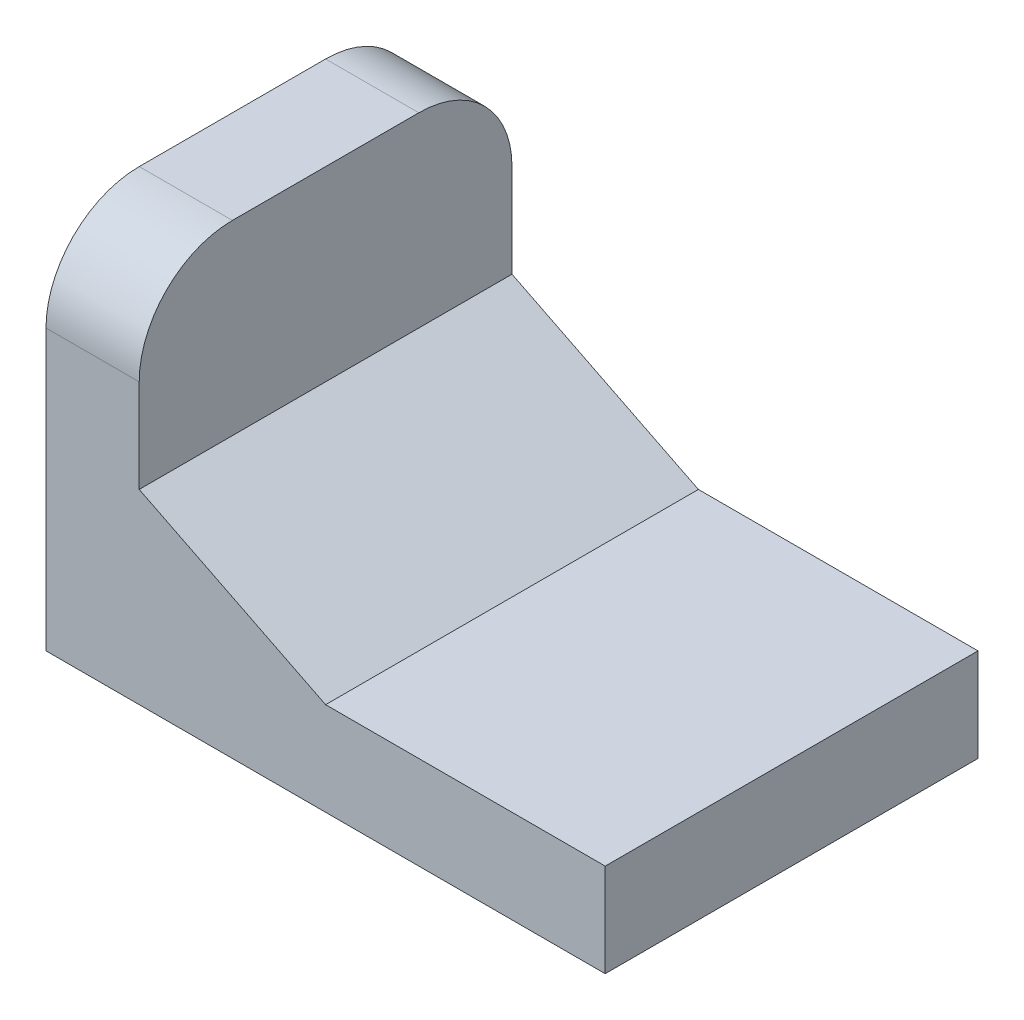
ISO-10303-21;
HEADER;
FILE_DESCRIPTION(('STEP AP214'),'2;1');
FILE_NAME('part.step','',(''),(''),'','','');
FILE_SCHEMA(('AUTOMOTIVE_DESIGN { 1 0 10303 214 1 1 1 1 }'));
ENDSEC;
DATA;
#1=APPLICATION_CONTEXT('core data for automotive mechanical design processes');
#2=APPLICATION_PROTOCOL_DEFINITION('international standard','automotive_design',2000,#1);
#3=PRODUCT_CONTEXT('',#1,'mechanical');
#4=PRODUCT('Part','Part','',(#3));
#5=PRODUCT_RELATED_PRODUCT_CATEGORY('part','',(#4));
#6=PRODUCT_DEFINITION_FORMATION('','',#4);
#7=PRODUCT_DEFINITION_CONTEXT('part definition',#1,'design');
#8=PRODUCT_DEFINITION('design','',#6,#7);
#9=PRODUCT_DEFINITION_SHAPE('','',#8);
#10=(LENGTH_UNIT() NAMED_UNIT(*) SI_UNIT(.MILLI.,.METRE.));
#11=(NAMED_UNIT(*) PLANE_ANGLE_UNIT() SI_UNIT($,.RADIAN.));
#12=(NAMED_UNIT(*) SI_UNIT($,.STERADIAN.) SOLID_ANGLE_UNIT());
#13=UNCERTAINTY_MEASURE_WITH_UNIT(LENGTH_MEASURE(1.E-05),#10,'distance_accuracy_value','');
#14=(GEOMETRIC_REPRESENTATION_CONTEXT(3) GLOBAL_UNCERTAINTY_ASSIGNED_CONTEXT((#13)) GLOBAL_UNIT_ASSIGNED_CONTEXT((#10,
#11,#12)) REPRESENTATION_CONTEXT('',''));
#15=CARTESIAN_POINT('',(0.,0.,0.));
#16=DIRECTION('',(0.,0.,1.));
#17=DIRECTION('',(1.,0.,0.));
#18=AXIS2_PLACEMENT_3D('',#15,#16,#17);
#19=CARTESIAN_POINT('',(8.53680720828743,4.62082072878893,12.));
#20=DIRECTION('',(0.,1.,0.));
#21=DIRECTION('',(0.,0.,1.));
#22=AXIS2_PLACEMENT_3D('',#19,#20,#21);
#23=PLANE('',#22);
#24=DIRECTION('',(1.,0.,0.));
#25=VECTOR('',#24,1.);
#26=CARTESIAN_POINT('',(8.53680720828743,4.62082072878893,8.));
#27=LINE('',#26,#25);
#28=CARTESIAN_POINT('',(8.53680720828743,4.62082072878893,8.));
#29=VERTEX_POINT('',#28);
#30=CARTESIAN_POINT('',(14.5368072082874,4.62082072878893,8.));
#31=VERTEX_POINT('',#30);
#32=EDGE_CURVE('E131',#29,#31,#27,.T.);
#33=ORIENTED_EDGE('',*,*,#32,.T.);
#34=DIRECTION('',(0.,0.,-1.));
#35=VECTOR('',#34,1.);
#36=CARTESIAN_POINT('',(14.5368072082874,4.62082072878893,12.));
#37=LINE('',#36,#35);
#38=CARTESIAN_POINT('',(14.5368072082874,4.62082072878893,12.));
#39=VERTEX_POINT('',#38);
#40=EDGE_CURVE('E116',#39,#31,#37,.T.);
#41=ORIENTED_EDGE('',*,*,#40,.F.);
#42=DIRECTION('',(1.,0.,0.));
#43=VECTOR('',#42,1.);
#44=CARTESIAN_POINT('',(8.53680720828743,4.62082072878893,12.));
#45=LINE('',#44,#43);
#46=CARTESIAN_POINT('',(8.53680720828743,4.62082072878893,12.));
#47=VERTEX_POINT('',#46);
#48=EDGE_CURVE('E122',#47,#39,#45,.T.);
#49=ORIENTED_EDGE('',*,*,#48,.F.);
#50=DIRECTION('',(0.,0.,-1.));
#51=VECTOR('',#50,1.);
#52=CARTESIAN_POINT('',(8.53680720828743,4.62082072878893,12.));
#53=LINE('',#52,#51);
#54=EDGE_CURVE('E174',#47,#29,#53,.T.);
#55=ORIENTED_EDGE('',*,*,#54,.T.);
#56=EDGE_LOOP('',(#33,#41,#49,#55));
#57=FACE_BOUND('',#56,.T.);
#58=ADVANCED_FACE('F38',(#57),#23,.F.);
#59=CARTESIAN_POINT('',(14.5368072082874,4.62082072878893,12.));
#60=DIRECTION('',(-1.,0.,0.));
#61=DIRECTION('',(0.,0.,1.));
#62=AXIS2_PLACEMENT_3D('',#59,#60,#61);
#63=PLANE('',#62);
#64=DIRECTION('',(0.,1.,0.));
#65=VECTOR('',#64,1.);
#66=CARTESIAN_POINT('',(14.5368072082874,4.62082072878893,8.));
#67=LINE('',#66,#65);
#68=CARTESIAN_POINT('',(14.5368072082874,5.62082072878893,8.));
#69=VERTEX_POINT('',#68);
#70=EDGE_CURVE('E190',#31,#69,#67,.T.);
#71=ORIENTED_EDGE('',*,*,#70,.T.);
#72=DIRECTION('',(0.,0.,-1.));
#73=VECTOR('',#72,1.);
#74=CARTESIAN_POINT('',(14.5368072082874,5.62082072878893,12.));
#75=LINE('',#74,#73);
#76=CARTESIAN_POINT('',(14.5368072082874,5.62082072878893,12.));
#77=VERTEX_POINT('',#76);
#78=EDGE_CURVE('E118',#77,#69,#75,.T.);
#79=ORIENTED_EDGE('',*,*,#78,.F.);
#80=DIRECTION('',(0.,1.,0.));
#81=VECTOR('',#80,1.);
#82=CARTESIAN_POINT('',(14.5368072082874,4.62082072878893,12.));
#83=LINE('',#82,#81);
#84=EDGE_CURVE('E111',#39,#77,#83,.T.);
#85=ORIENTED_EDGE('',*,*,#84,.F.);
#86=ORIENTED_EDGE('',*,*,#40,.T.);
#87=EDGE_LOOP('',(#71,#79,#85,#86));
#88=FACE_BOUND('',#87,.T.);
#89=ADVANCED_FACE('F114',(#88),#63,.F.);
#90=CARTESIAN_POINT('',(8.53680720828743,5.62082072878893,12.));
#91=DIRECTION('',(0.,1.,0.));
#92=DIRECTION('',(0.,0.,1.));
#93=AXIS2_PLACEMENT_3D('',#90,#91,#92);
#94=PLANE('',#93);
#95=DIRECTION('',(1.,0.,0.));
#96=VECTOR('',#95,1.);
#97=CARTESIAN_POINT('',(8.53680720828743,5.62082072878893,8.));
#98=LINE('',#97,#96);
#99=CARTESIAN_POINT('',(11.5368072082874,5.62082072878893,8.));
#100=VERTEX_POINT('',#99);
#101=EDGE_CURVE('E187',#100,#69,#98,.T.);
#102=ORIENTED_EDGE('',*,*,#101,.F.);
#103=DIRECTION('',(0.,0.,-1.));
#104=VECTOR('',#103,1.);
#105=CARTESIAN_POINT('',(11.5368072082874,5.62082072878893,12.));
#106=LINE('',#105,#104);
#107=CARTESIAN_POINT('',(11.5368072082874,5.62082072878893,12.));
#108=VERTEX_POINT('',#107);
#109=EDGE_CURVE('E137',#108,#100,#106,.T.);
#110=ORIENTED_EDGE('',*,*,#109,.F.);
#111=DIRECTION('',(1.,0.,0.));
#112=VECTOR('',#111,1.);
#113=CARTESIAN_POINT('',(8.53680720828743,5.62082072878893,12.));
#114=LINE('',#113,#112);
#115=EDGE_CURVE('E121',#108,#77,#114,.T.);
#116=ORIENTED_EDGE('',*,*,#115,.T.);
#117=ORIENTED_EDGE('',*,*,#78,.T.);
#118=EDGE_LOOP('',(#102,#110,#116,#117));
#119=FACE_BOUND('',#118,.T.);
#120=ADVANCED_FACE('F189',(#119),#94,.T.);
#121=CARTESIAN_POINT('',(9.53680720828743,6.62082072878893,12.));
#122=DIRECTION('',(-0.447213595499958,-0.894427190999916,0.));
#123=DIRECTION('',(0.894427190999916,-0.447213595499958,0.));
#124=AXIS2_PLACEMENT_3D('',#121,#122,#123);
#125=PLANE('',#124);
#126=DIRECTION('',(-0.894427190999916,0.447213595499958,0.));
#127=VECTOR('',#126,1.);
#128=CARTESIAN_POINT('',(9.53680720828743,6.62082072878893,8.));
#129=LINE('',#128,#127);
#130=CARTESIAN_POINT('',(9.53680720828743,6.62082072878893,8.));
#131=VERTEX_POINT('',#130);
#132=EDGE_CURVE('E182',#100,#131,#129,.T.);
#133=ORIENTED_EDGE('',*,*,#132,.T.);
#134=DIRECTION('',(0.,0.,-1.));
#135=VECTOR('',#134,1.);
#136=CARTESIAN_POINT('',(9.53680720828743,6.62082072878893,12.));
#137=LINE('',#136,#135);
#138=CARTESIAN_POINT('',(9.53680720828743,6.62082072878893,12.));
#139=VERTEX_POINT('',#138);
#140=EDGE_CURVE('E171',#139,#131,#137,.T.);
#141=ORIENTED_EDGE('',*,*,#140,.F.);
#142=DIRECTION('',(-0.894427190999916,0.447213595499958,0.));
#143=VECTOR('',#142,1.);
#144=CARTESIAN_POINT('',(9.53680720828743,6.62082072878893,12.));
#145=LINE('',#144,#143);
#146=EDGE_CURVE('E183',#108,#139,#145,.T.);
#147=ORIENTED_EDGE('',*,*,#146,.F.);
#148=ORIENTED_EDGE('',*,*,#109,.T.);
#149=EDGE_LOOP('',(#133,#141,#147,#148));
#150=FACE_BOUND('',#149,.T.);
#151=ADVANCED_FACE('F180',(#150),#125,.F.);
#152=CARTESIAN_POINT('',(9.53680720828743,4.62082072878893,12.));
#153=DIRECTION('',(-1.,0.,0.));
#154=DIRECTION('',(0.,-1.,0.));
#155=AXIS2_PLACEMENT_3D('',#152,#153,#154);
#156=PLANE('',#155);
#157=DIRECTION('',(0.,1.,0.));
#158=VECTOR('',#157,1.);
#159=CARTESIAN_POINT('',(9.53680720828743,4.62082072878893,8.));
#160=LINE('',#159,#158);
#161=CARTESIAN_POINT('',(9.53680720828743,7.62082072878893,8.));
#162=VERTEX_POINT('',#161);
#163=EDGE_CURVE('E161',#131,#162,#160,.T.);
#164=ORIENTED_EDGE('',*,*,#163,.T.);
#165=CARTESIAN_POINT('',(9.53680720828743,7.62082072878893,9.));
#166=DIRECTION('',(-1.,0.,0.));
#167=DIRECTION('',(0.,-1.,0.));
#168=AXIS2_PLACEMENT_3D('',#165,#166,#167);
#169=CIRCLE('',#168,1.);
#170=CARTESIAN_POINT('',(9.53680720828743,8.62082072878893,9.));
#171=VERTEX_POINT('',#170);
#172=EDGE_CURVE('E142',#162,#171,#169,.F.);
#173=ORIENTED_EDGE('',*,*,#172,.T.);
#174=DIRECTION('',(0.,0.,-1.));
#175=VECTOR('',#174,1.);
#176=CARTESIAN_POINT('',(9.53680720828743,8.62082072878893,12.));
#177=LINE('',#176,#175);
#178=CARTESIAN_POINT('',(9.53680720828743,8.62082072878893,11.));
#179=VERTEX_POINT('',#178);
#180=EDGE_CURVE('E167',#179,#171,#177,.T.);
#181=ORIENTED_EDGE('',*,*,#180,.F.);
#182=CARTESIAN_POINT('',(9.53680720828743,7.62082072878893,11.));
#183=DIRECTION('',(-1.,0.,0.));
#184=DIRECTION('',(0.,-1.,0.));
#185=AXIS2_PLACEMENT_3D('',#182,#183,#184);
#186=CIRCLE('',#185,1.);
#187=CARTESIAN_POINT('',(9.53680720828743,7.62082072878893,12.));
#188=VERTEX_POINT('',#187);
#189=EDGE_CURVE('E135',#179,#188,#186,.F.);
#190=ORIENTED_EDGE('',*,*,#189,.T.);
#191=DIRECTION('',(0.,1.,0.));
#192=VECTOR('',#191,1.);
#193=CARTESIAN_POINT('',(9.53680720828743,4.62082072878893,12.));
#194=LINE('',#193,#192);
#195=EDGE_CURVE('E195',#139,#188,#194,.T.);
#196=ORIENTED_EDGE('',*,*,#195,.F.);
#197=ORIENTED_EDGE('',*,*,#140,.T.);
#198=EDGE_LOOP('',(#164,#173,#181,#190,#196,#197));
#199=FACE_BOUND('',#198,.T.);
#200=ADVANCED_FACE('F166',(#199),#156,.F.);
#201=CARTESIAN_POINT('',(8.53680720828743,8.62082072878893,12.));
#202=DIRECTION('',(0.,1.,0.));
#203=DIRECTION('',(0.,0.,1.));
#204=AXIS2_PLACEMENT_3D('',#201,#202,#203);
#205=PLANE('',#204);
#206=ORIENTED_EDGE('',*,*,#180,.T.);
#207=DIRECTION('',(1.,0.,0.));
#208=VECTOR('',#207,1.);
#209=CARTESIAN_POINT('',(8.53680720828743,8.62082072878893,9.));
#210=LINE('',#209,#208);
#211=CARTESIAN_POINT('',(8.53680720828743,8.62082072878893,9.));
#212=VERTEX_POINT('',#211);
#213=EDGE_CURVE('E59',#171,#212,#210,.F.);
#214=ORIENTED_EDGE('',*,*,#213,.T.);
#215=DIRECTION('',(0.,0.,-1.));
#216=VECTOR('',#215,1.);
#217=CARTESIAN_POINT('',(8.53680720828743,8.62082072878893,12.));
#218=LINE('',#217,#216);
#219=CARTESIAN_POINT('',(8.53680720828743,8.62082072878893,11.));
#220=VERTEX_POINT('',#219);
#221=EDGE_CURVE('E154',#220,#212,#218,.T.);
#222=ORIENTED_EDGE('',*,*,#221,.F.);
#223=DIRECTION('',(1.,0.,0.));
#224=VECTOR('',#223,1.);
#225=CARTESIAN_POINT('',(8.53680720828743,8.62082072878893,11.));
#226=LINE('',#225,#224);
#227=EDGE_CURVE('E144',#220,#179,#226,.T.);
#228=ORIENTED_EDGE('',*,*,#227,.T.);
#229=EDGE_LOOP('',(#206,#214,#222,#228));
#230=FACE_BOUND('',#229,.T.);
#231=ADVANCED_FACE('F169',(#230),#205,.T.);
#232=CARTESIAN_POINT('',(8.53680720828743,4.62082072878893,12.));
#233=DIRECTION('',(-1.,0.,0.));
#234=DIRECTION('',(0.,0.,1.));
#235=AXIS2_PLACEMENT_3D('',#232,#233,#234);
#236=PLANE('',#235);
#237=ORIENTED_EDGE('',*,*,#221,.T.);
#238=CARTESIAN_POINT('',(8.53680720828743,7.62082072878893,9.));
#239=DIRECTION('',(-1.,0.,0.));
#240=DIRECTION('',(0.,0.,1.));
#241=AXIS2_PLACEMENT_3D('',#238,#239,#240);
#242=CIRCLE('',#241,1.);
#243=CARTESIAN_POINT('',(8.53680720828743,7.62082072878893,8.));
#244=VERTEX_POINT('',#243);
#245=EDGE_CURVE('E46',#212,#244,#242,.T.);
#246=ORIENTED_EDGE('',*,*,#245,.T.);
#247=DIRECTION('',(0.,1.,0.));
#248=VECTOR('',#247,1.);
#249=CARTESIAN_POINT('',(8.53680720828743,4.62082072878893,8.));
#250=LINE('',#249,#248);
#251=EDGE_CURVE('E128',#29,#244,#250,.T.);
#252=ORIENTED_EDGE('',*,*,#251,.F.);
#253=ORIENTED_EDGE('',*,*,#54,.F.);
#254=DIRECTION('',(0.,1.,0.));
#255=VECTOR('',#254,1.);
#256=CARTESIAN_POINT('',(8.53680720828743,4.62082072878893,12.));
#257=LINE('',#256,#255);
#258=CARTESIAN_POINT('',(8.53680720828743,7.62082072878893,12.));
#259=VERTEX_POINT('',#258);
#260=EDGE_CURVE('E126',#47,#259,#257,.T.);
#261=ORIENTED_EDGE('',*,*,#260,.T.);
#262=CARTESIAN_POINT('',(8.53680720828743,7.62082072878893,11.));
#263=DIRECTION('',(-1.,0.,0.));
#264=DIRECTION('',(0.,0.,1.));
#265=AXIS2_PLACEMENT_3D('',#262,#263,#264);
#266=CIRCLE('',#265,1.);
#267=EDGE_CURVE('E148',#259,#220,#266,.T.);
#268=ORIENTED_EDGE('',*,*,#267,.T.);
#269=EDGE_LOOP('',(#237,#246,#252,#253,#261,#268));
#270=FACE_BOUND('',#269,.T.);
#271=ADVANCED_FACE('F153',(#270),#236,.T.);
#272=CARTESIAN_POINT('',(8.53680720828743,4.62082072878893,12.));
#273=DIRECTION('',(0.,0.,1.));
#274=DIRECTION('',(1.,0.,0.));
#275=AXIS2_PLACEMENT_3D('',#272,#273,#274);
#276=PLANE('',#275);
#277=ORIENTED_EDGE('',*,*,#195,.T.);
#278=DIRECTION('',(1.,0.,0.));
#279=VECTOR('',#278,1.);
#280=CARTESIAN_POINT('',(8.53680720828743,7.62082072878893,12.));
#281=LINE('',#280,#279);
#282=EDGE_CURVE('E11',#188,#259,#281,.F.);
#283=ORIENTED_EDGE('',*,*,#282,.T.);
#284=ORIENTED_EDGE('',*,*,#260,.F.);
#285=ORIENTED_EDGE('',*,*,#48,.T.);
#286=ORIENTED_EDGE('',*,*,#84,.T.);
#287=ORIENTED_EDGE('',*,*,#115,.F.);
#288=ORIENTED_EDGE('',*,*,#146,.T.);
#289=EDGE_LOOP('',(#277,#283,#284,#285,#286,#287,#288));
#290=FACE_BOUND('',#289,.T.);
#291=ADVANCED_FACE('F125',(#290),#276,.T.);
#292=CARTESIAN_POINT('',(8.53680720828743,4.62082072878893,8.));
#293=DIRECTION('',(0.,0.,1.));
#294=DIRECTION('',(1.,0.,0.));
#295=AXIS2_PLACEMENT_3D('',#292,#293,#294);
#296=PLANE('',#295);
#297=ORIENTED_EDGE('',*,*,#251,.T.);
#298=DIRECTION('',(1.,0.,0.));
#299=VECTOR('',#298,1.);
#300=CARTESIAN_POINT('',(9.53680720828743,7.62082072878893,8.));
#301=LINE('',#300,#299);
#302=EDGE_CURVE('E132',#244,#162,#301,.T.);
#303=ORIENTED_EDGE('',*,*,#302,.T.);
#304=ORIENTED_EDGE('',*,*,#163,.F.);
#305=ORIENTED_EDGE('',*,*,#132,.F.);
#306=ORIENTED_EDGE('',*,*,#101,.T.);
#307=ORIENTED_EDGE('',*,*,#70,.F.);
#308=ORIENTED_EDGE('',*,*,#32,.F.);
#309=EDGE_LOOP('',(#297,#303,#304,#305,#306,#307,#308));
#310=FACE_BOUND('',#309,.T.);
#311=ADVANCED_FACE('F158',(#310),#296,.F.);
#312=CARTESIAN_POINT('',(8.53680720828743,7.62082072878893,9.));
#313=DIRECTION('',(-1.,0.,0.));
#314=DIRECTION('',(0.,0.,1.));
#315=AXIS2_PLACEMENT_3D('',#312,#313,#314);
#316=CYLINDRICAL_SURFACE('',#315,1.);
#317=ORIENTED_EDGE('',*,*,#245,.F.);
#318=ORIENTED_EDGE('',*,*,#213,.F.);
#319=ORIENTED_EDGE('',*,*,#172,.F.);
#320=ORIENTED_EDGE('',*,*,#302,.F.);
#321=EDGE_LOOP('',(#317,#318,#319,#320));
#322=FACE_BOUND('',#321,.T.);
#323=ADVANCED_FACE('F163',(#322),#316,.T.);
#324=CARTESIAN_POINT('',(8.53680720828743,7.62082072878893,11.));
#325=DIRECTION('',(1.,0.,0.));
#326=DIRECTION('',(0.,0.,-1.));
#327=AXIS2_PLACEMENT_3D('',#324,#325,#326);
#328=CYLINDRICAL_SURFACE('',#327,1.);
#329=ORIENTED_EDGE('',*,*,#267,.F.);
#330=ORIENTED_EDGE('',*,*,#282,.F.);
#331=ORIENTED_EDGE('',*,*,#189,.F.);
#332=ORIENTED_EDGE('',*,*,#227,.F.);
#333=EDGE_LOOP('',(#329,#330,#331,#332));
#334=FACE_BOUND('',#333,.T.);
#335=ADVANCED_FACE('F40',(#334),#328,.T.);
#336=CLOSED_SHELL('',(#58,#89,#120,#151,#200,#231,#271,#291,#311,#323,#335));
#337=MANIFOLD_SOLID_BREP('B2',#336);
#338=ADVANCED_BREP_SHAPE_REPRESENTATION('',(#18,#337),#14);
#339=SHAPE_DEFINITION_REPRESENTATION(#9,#338);
ENDSEC;
END-ISO-10303-21;
